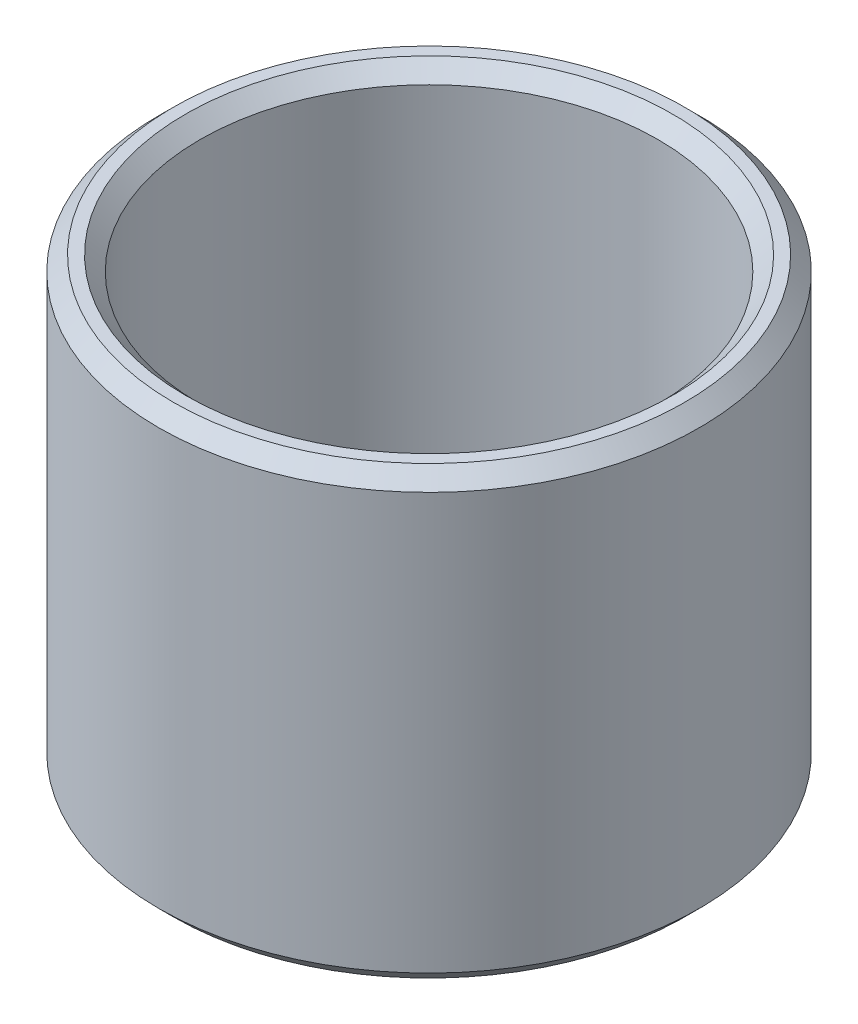
ISO-10303-21;
HEADER;
FILE_DESCRIPTION(('STEP AP214'),'2;1');
FILE_NAME('part.step','',(''),(''),'','','');
FILE_SCHEMA(('AUTOMOTIVE_DESIGN { 1 0 10303 214 1 1 1 1 }'));
ENDSEC;
DATA;
#1=APPLICATION_CONTEXT('core data for automotive mechanical design processes');
#2=APPLICATION_PROTOCOL_DEFINITION('international standard','automotive_design',2000,#1);
#3=PRODUCT_CONTEXT('',#1,'mechanical');
#4=PRODUCT('Part','Part','',(#3));
#5=PRODUCT_RELATED_PRODUCT_CATEGORY('part','',(#4));
#6=PRODUCT_DEFINITION_FORMATION('','',#4);
#7=PRODUCT_DEFINITION_CONTEXT('part definition',#1,'design');
#8=PRODUCT_DEFINITION('design','',#6,#7);
#9=PRODUCT_DEFINITION_SHAPE('','',#8);
#10=(LENGTH_UNIT() NAMED_UNIT(*) SI_UNIT(.MILLI.,.METRE.));
#11=(NAMED_UNIT(*) PLANE_ANGLE_UNIT() SI_UNIT($,.RADIAN.));
#12=(NAMED_UNIT(*) SI_UNIT($,.STERADIAN.) SOLID_ANGLE_UNIT());
#13=UNCERTAINTY_MEASURE_WITH_UNIT(LENGTH_MEASURE(1.E-05),#10,'distance_accuracy_value','');
#14=(GEOMETRIC_REPRESENTATION_CONTEXT(3) GLOBAL_UNCERTAINTY_ASSIGNED_CONTEXT((#13)) GLOBAL_UNIT_ASSIGNED_CONTEXT((#10,
#11,#12)) REPRESENTATION_CONTEXT('',''));
#15=CARTESIAN_POINT('',(0.,0.,0.));
#16=DIRECTION('',(0.,0.,1.));
#17=DIRECTION('',(1.,0.,0.));
#18=AXIS2_PLACEMENT_3D('',#15,#16,#17);
#19=CARTESIAN_POINT('',(0.,94.785020663619,0.));
#20=DIRECTION('',(0.,-1.,0.));
#21=DIRECTION('',(0.,0.,-1.));
#22=AXIS2_PLACEMENT_3D('',#19,#20,#21);
#23=CYLINDRICAL_SURFACE('',#22,57.5);
#24=CARTESIAN_POINT('',(0.,3.11852298910036,0.));
#25=DIRECTION('',(0.,1.,0.));
#26=DIRECTION('',(0.,0.,1.));
#27=AXIS2_PLACEMENT_3D('',#24,#25,#26);
#28=CIRCLE('',#27,57.5);
#29=CARTESIAN_POINT('',(0.,3.11852298910036,57.5));
#30=VERTEX_POINT('',#29);
#31=EDGE_CURVE('E10',#30,#30,#28,.T.);
#32=ORIENTED_EDGE('',*,*,#31,.T.);
#33=EDGE_LOOP('',(#32));
#34=FACE_BOUND('',#33,.T.);
#35=CARTESIAN_POINT('',(0.,91.6664976745186,0.));
#36=DIRECTION('',(0.,1.,0.));
#37=DIRECTION('',(0.,0.,1.));
#38=AXIS2_PLACEMENT_3D('',#35,#36,#37);
#39=CIRCLE('',#38,57.5);
#40=CARTESIAN_POINT('',(0.,91.6664976745186,57.5));
#41=VERTEX_POINT('',#40);
#42=EDGE_CURVE('E50',#41,#41,#39,.F.);
#43=ORIENTED_EDGE('',*,*,#42,.T.);
#44=EDGE_LOOP('',(#43));
#45=FACE_BOUND('',#44,.T.);
#46=ADVANCED_FACE('F39',(#34,#45),#23,.T.);
#47=CARTESIAN_POINT('',(0.,94.785020663619,0.));
#48=DIRECTION('',(0.,1.,0.));
#49=DIRECTION('',(0.,0.,1.));
#50=AXIS2_PLACEMENT_3D('',#47,#48,#49);
#51=PLANE('',#50);
#52=CARTESIAN_POINT('',(0.,94.785020663619,0.));
#53=DIRECTION('',(0.,1.,0.));
#54=DIRECTION('',(0.,0.,1.));
#55=AXIS2_PLACEMENT_3D('',#52,#53,#54);
#56=CIRCLE('',#55,51.8180866409953);
#57=CARTESIAN_POINT('',(0.,94.785020663619,51.8180866409953));
#58=VERTEX_POINT('',#57);
#59=EDGE_CURVE('E58',#58,#58,#56,.F.);
#60=ORIENTED_EDGE('',*,*,#59,.T.);
#61=EDGE_LOOP('',(#60));
#62=FACE_BOUND('',#61,.T.);
#63=CARTESIAN_POINT('',(0.,94.785020663619,0.));
#64=DIRECTION('',(0.,1.,0.));
#65=DIRECTION('',(0.,0.,1.));
#66=AXIS2_PLACEMENT_3D('',#63,#64,#65);
#67=CIRCLE('',#66,54.3814770108996);
#68=CARTESIAN_POINT('',(0.,94.785020663619,54.3814770108996));
#69=VERTEX_POINT('',#68);
#70=EDGE_CURVE('E61',#69,#69,#67,.T.);
#71=ORIENTED_EDGE('',*,*,#70,.T.);
#72=EDGE_LOOP('',(#71));
#73=FACE_BOUND('',#72,.T.);
#74=ADVANCED_FACE('F88',(#62,#73),#51,.T.);
#75=CARTESIAN_POINT('',(0.,0.,0.));
#76=DIRECTION('',(0.,1.,0.));
#77=DIRECTION('',(0.,0.,1.));
#78=AXIS2_PLACEMENT_3D('',#75,#76,#77);
#79=PLANE('',#78);
#80=CARTESIAN_POINT('',(0.,0.,0.));
#81=DIRECTION('',(0.,1.,0.));
#82=DIRECTION('',(0.,0.,1.));
#83=AXIS2_PLACEMENT_3D('',#80,#81,#82);
#84=CIRCLE('',#83,51.8180866409953);
#85=CARTESIAN_POINT('',(0.,0.,-51.8180866409953));
#86=VERTEX_POINT('',#85);
#87=EDGE_CURVE('E51',#86,#86,#84,.T.);
#88=ORIENTED_EDGE('',*,*,#87,.T.);
#89=EDGE_LOOP('',(#88));
#90=FACE_BOUND('',#89,.T.);
#91=CARTESIAN_POINT('',(0.,0.,0.));
#92=DIRECTION('',(0.,1.,0.));
#93=DIRECTION('',(0.,0.,1.));
#94=AXIS2_PLACEMENT_3D('',#91,#92,#93);
#95=CIRCLE('',#94,54.3814770108996);
#96=CARTESIAN_POINT('',(0.,0.,54.3814770108996));
#97=VERTEX_POINT('',#96);
#98=EDGE_CURVE('E54',#97,#97,#95,.F.);
#99=ORIENTED_EDGE('',*,*,#98,.T.);
#100=EDGE_LOOP('',(#99));
#101=FACE_BOUND('',#100,.T.);
#102=ADVANCED_FACE('F83',(#90,#101),#79,.F.);
#103=CARTESIAN_POINT('',(0.,94.785020663619,0.));
#104=DIRECTION('',(0.,-1.,0.));
#105=DIRECTION('',(0.,0.,-1.));
#106=AXIS2_PLACEMENT_3D('',#103,#104,#105);
#107=CYLINDRICAL_SURFACE('',#106,48.6995636518949);
#108=CARTESIAN_POINT('',(0.,91.6664976745187,0.));
#109=DIRECTION('',(0.,1.,0.));
#110=DIRECTION('',(0.,0.,1.));
#111=AXIS2_PLACEMENT_3D('',#108,#109,#110);
#112=CIRCLE('',#111,48.6995636518949);
#113=CARTESIAN_POINT('',(0.,91.6664976745187,48.6995636518949));
#114=VERTEX_POINT('',#113);
#115=EDGE_CURVE('E67',#114,#114,#112,.T.);
#116=ORIENTED_EDGE('',*,*,#115,.T.);
#117=EDGE_LOOP('',(#116));
#118=FACE_BOUND('',#117,.T.);
#119=CARTESIAN_POINT('',(0.,3.11852298910041,0.));
#120=DIRECTION('',(0.,1.,0.));
#121=DIRECTION('',(0.,0.,1.));
#122=AXIS2_PLACEMENT_3D('',#119,#120,#121);
#123=CIRCLE('',#122,48.6995636518949);
#124=CARTESIAN_POINT('',(0.,3.11852298910041,-48.6995636518949));
#125=VERTEX_POINT('',#124);
#126=EDGE_CURVE('E69',#125,#125,#123,.F.);
#127=ORIENTED_EDGE('',*,*,#126,.T.);
#128=EDGE_LOOP('',(#127));
#129=FACE_BOUND('',#128,.T.);
#130=ADVANCED_FACE('F71',(#118,#129),#107,.F.);
#131=CARTESIAN_POINT('',(0.,91.6664976745187,0.));
#132=DIRECTION('',(0.,1.,0.));
#133=DIRECTION('',(0.,0.,1.));
#134=AXIS2_PLACEMENT_3D('',#131,#132,#133);
#135=CONICAL_SURFACE('',#134,48.6995636518949,0.785398163397456);
#136=ORIENTED_EDGE('',*,*,#59,.F.);
#137=EDGE_LOOP('',(#136));
#138=FACE_BOUND('',#137,.T.);
#139=ORIENTED_EDGE('',*,*,#115,.F.);
#140=EDGE_LOOP('',(#139));
#141=FACE_BOUND('',#140,.T.);
#142=ADVANCED_FACE('F77',(#138,#141),#135,.F.);
#143=CARTESIAN_POINT('',(0.,0.,0.));
#144=DIRECTION('',(0.,-1.,0.));
#145=DIRECTION('',(0.,0.,-1.));
#146=AXIS2_PLACEMENT_3D('',#143,#144,#145);
#147=CONICAL_SURFACE('',#146,51.8180866409953,0.785398163397445);
#148=CARTESIAN_POINT('',(0.,3.11852298910041,-48.6995636518949));
#149=CARTESIAN_POINT('',(0.,3.08603837463061,-48.7320482663647));
#150=CARTESIAN_POINT('',(0.,3.05355376016082,-48.7645328808345));
#151=CARTESIAN_POINT('',(0.,2.98858453122123,-48.8295021097741));
#152=CARTESIAN_POINT('',(0.,2.95609991675143,-48.8619867242439));
#153=CARTESIAN_POINT('',(0.,2.89113068781184,-48.9269559531835));
#154=CARTESIAN_POINT('',(0.,2.85864607334204,-48.9594405676533));
#155=CARTESIAN_POINT('',(0.,2.79367684440245,-49.0244097965928));
#156=CARTESIAN_POINT('',(0.,2.76119222993266,-49.0568944110626));
#157=CARTESIAN_POINT('',(0.,2.69622300099306,-49.1218636400022));
#158=CARTESIAN_POINT('',(0.,2.66373838652327,-49.154348254472));
#159=CARTESIAN_POINT('',(0.,2.59876915758368,-49.2193174834116));
#160=CARTESIAN_POINT('',(0.,2.56628454311388,-49.2518020978814));
#161=CARTESIAN_POINT('',(0.,2.50131531417429,-49.316771326821));
#162=CARTESIAN_POINT('',(0.,2.46883069970449,-49.3492559412908));
#163=CARTESIAN_POINT('',(0.,2.4038614707649,-49.4142251702304));
#164=CARTESIAN_POINT('',(0.,2.3713768562951,-49.4467097847002));
#165=CARTESIAN_POINT('',(0.,2.30640762735551,-49.5116790136398));
#166=CARTESIAN_POINT('',(0.,2.27392301288572,-49.5441636281096));
#167=CARTESIAN_POINT('',(0.,2.20895378394612,-49.6091328570492));
#168=CARTESIAN_POINT('',(0.,2.17646916947633,-49.641617471519));
#169=CARTESIAN_POINT('',(0.,2.11149994053674,-49.7065867004586));
#170=CARTESIAN_POINT('',(0.,2.07901532606694,-49.7390713149284));
#171=CARTESIAN_POINT('',(0.,2.01404609712735,-49.8040405438679));
#172=CARTESIAN_POINT('',(0.,1.98156148265755,-49.8365251583377));
#173=CARTESIAN_POINT('',(0.,1.91659225371796,-49.9014943872773));
#174=CARTESIAN_POINT('',(0.,1.88410763924816,-49.9339790017471));
#175=CARTESIAN_POINT('',(0.,1.81913841030857,-49.9989482306867));
#176=CARTESIAN_POINT('',(0.,1.78665379583878,-50.0314328451565));
#177=CARTESIAN_POINT('',(0.,1.72168456689919,-50.0964020740961));
#178=CARTESIAN_POINT('',(0.,1.68919995242939,-50.1288866885659));
#179=CARTESIAN_POINT('',(0.,1.6242307234898,-50.1938559175055));
#180=CARTESIAN_POINT('',(0.,1.59174610902,-50.2263405319753));
#181=CARTESIAN_POINT('',(0.,1.52677688008041,-50.2913097609149));
#182=CARTESIAN_POINT('',(0.,1.49429226561061,-50.3237943753847));
#183=CARTESIAN_POINT('',(0.,1.42932303667102,-50.3887636043243));
#184=CARTESIAN_POINT('',(0.,1.39683842220123,-50.4212482187941));
#185=CARTESIAN_POINT('',(0.,1.33186919326163,-50.4862174477337));
#186=CARTESIAN_POINT('',(0.,1.29938457879184,-50.5187020622035));
#187=CARTESIAN_POINT('',(0.,1.23441534985225,-50.583671291143));
#188=CARTESIAN_POINT('',(0.,1.20193073538245,-50.6161559056128));
#189=CARTESIAN_POINT('',(0.,1.13696150644286,-50.6811251345524));
#190=CARTESIAN_POINT('',(0.,1.10447689197306,-50.7136097490222));
#191=CARTESIAN_POINT('',(0.,1.03950766303347,-50.7785789779618));
#192=CARTESIAN_POINT('',(0.,1.00702304856368,-50.8110635924316));
#193=CARTESIAN_POINT('',(0.,0.942053819624083,-50.8760328213712));
#194=CARTESIAN_POINT('',(0.,0.909569205154286,-50.908517435841));
#195=CARTESIAN_POINT('',(0.,0.844599976214694,-50.9734866647806));
#196=CARTESIAN_POINT('',(0.,0.812115361744898,-51.0059712792504));
#197=CARTESIAN_POINT('',(0.,0.747146132805307,-51.07094050819));
#198=CARTESIAN_POINT('',(0.,0.714661518335511,-51.1034251226598));
#199=CARTESIAN_POINT('',(0.,0.649692289395919,-51.1683943515994));
#200=CARTESIAN_POINT('',(0.,0.617207674926123,-51.2008789660692));
#201=CARTESIAN_POINT('',(0.,0.552238445986531,-51.2658481950088));
#202=CARTESIAN_POINT('',(0.,0.519753831516735,-51.2983328094786));
#203=CARTESIAN_POINT('',(0.,0.454784602577143,-51.3633020384181));
#204=CARTESIAN_POINT('',(0.,0.422299988107348,-51.3957866528879));
#205=CARTESIAN_POINT('',(0.,0.357330759167756,-51.4607558818275));
#206=CARTESIAN_POINT('',(0.,0.324846144697959,-51.4932404962973));
#207=CARTESIAN_POINT('',(0.,0.259876915758367,-51.5582097252369));
#208=CARTESIAN_POINT('',(0.,0.227392301288571,-51.5906943397067));
#209=CARTESIAN_POINT('',(0.,0.16242307234898,-51.6556635686463));
#210=CARTESIAN_POINT('',(0.,0.129938457879184,-51.6881481831161));
#211=CARTESIAN_POINT('',(0.,0.0649692289395918,-51.7531174120557));
#212=CARTESIAN_POINT('',(0.,0.0324846144697957,-51.7856020265255));
#213=CARTESIAN_POINT('',(0.,0.,-51.8180866409953));
#214=B_SPLINE_CURVE_WITH_KNOTS('',3,(#148,#149,#150,#151,#152,#153,#154,#155,#156,#157,#158,
#159,#160,#161,#162,#163,#164,#165,#166,#167,#168,#169,#170,#171,#172,#173,#174,#175,#176,#177,
#178,#179,#180,#181,#182,#183,#184,#185,#186,#187,#188,#189,#190,#191,#192,#193,#194,#195,#196,
#197,#198,#199,#200,#201,#202,#203,#204,#205,#206,#207,#208,#209,#210,#211,#212,#213),
.UNSPECIFIED.,.F.,.F.,(4,2,2,2,2,2,2,2,2,2,2,2,2,2,2,2,2,2,2,2,2,2,2,2,2,2,2,2,2,2,2,2,4),(0.,
0.13782054705494,0.275641094109881,0.413461641164821,0.551282188219757,0.689102735274697,
0.826923282329638,0.964743829384578,1.10256437643952,1.24038492349446,1.37820547054939,
1.51602601760434,1.65384656465928,1.79166711171422,1.92948765876916,2.0673082058241,
2.20512875287904,2.34294929993397,2.48076984698891,2.61859039404385,2.75641094109879,
2.89423148815373,3.03205203520867,3.16987258226361,3.30769312931855,3.44551367637349,
3.58333422342843,3.72115477048337,3.85897531753831,3.99679586459325,4.13461641164819,
4.27243695870313,4.41025750575807),.UNSPECIFIED.);
#215=EDGE_CURVE('BSEAM73',#125,#86,#214,.T.);
#216=ORIENTED_EDGE('',*,*,#126,.F.);
#217=ORIENTED_EDGE('',*,*,#87,.F.);
#218=ORIENTED_EDGE('',*,*,#215,.T.);
#219=ORIENTED_EDGE('',*,*,#215,.F.);
#220=EDGE_LOOP('',(#216,#218,#217,#219));
#221=FACE_BOUND('',#220,.T.);
#222=ADVANCED_FACE('F73',(#221),#147,.F.);
#223=CARTESIAN_POINT('',(0.,3.11852298910036,0.));
#224=DIRECTION('',(0.,1.,0.));
#225=DIRECTION('',(0.,0.,1.));
#226=AXIS2_PLACEMENT_3D('',#223,#224,#225);
#227=CONICAL_SURFACE('',#226,57.5,0.785398163397453);
#228=ORIENTED_EDGE('',*,*,#98,.F.);
#229=EDGE_LOOP('',(#228));
#230=FACE_BOUND('',#229,.T.);
#231=ORIENTED_EDGE('',*,*,#31,.F.);
#232=EDGE_LOOP('',(#231));
#233=FACE_BOUND('',#232,.T.);
#234=ADVANCED_FACE('F76',(#230,#233),#227,.T.);
#235=CARTESIAN_POINT('',(0.,94.785020663619,0.));
#236=DIRECTION('',(0.,-1.,0.));
#237=DIRECTION('',(0.,0.,-1.));
#238=AXIS2_PLACEMENT_3D('',#235,#236,#237);
#239=CONICAL_SURFACE('',#238,54.3814770108996,0.785398163397448);
#240=ORIENTED_EDGE('',*,*,#42,.F.);
#241=EDGE_LOOP('',(#240));
#242=FACE_BOUND('',#241,.T.);
#243=ORIENTED_EDGE('',*,*,#70,.F.);
#244=EDGE_LOOP('',(#243));
#245=FACE_BOUND('',#244,.T.);
#246=ADVANCED_FACE('F45',(#242,#245),#239,.T.);
#247=CLOSED_SHELL('',(#46,#74,#102,#130,#142,#222,#234,#246));
#248=MANIFOLD_SOLID_BREP('B2',#247);
#249=ADVANCED_BREP_SHAPE_REPRESENTATION('',(#18,#248),#14);
#250=SHAPE_DEFINITION_REPRESENTATION(#9,#249);
ENDSEC;
END-ISO-10303-21;
